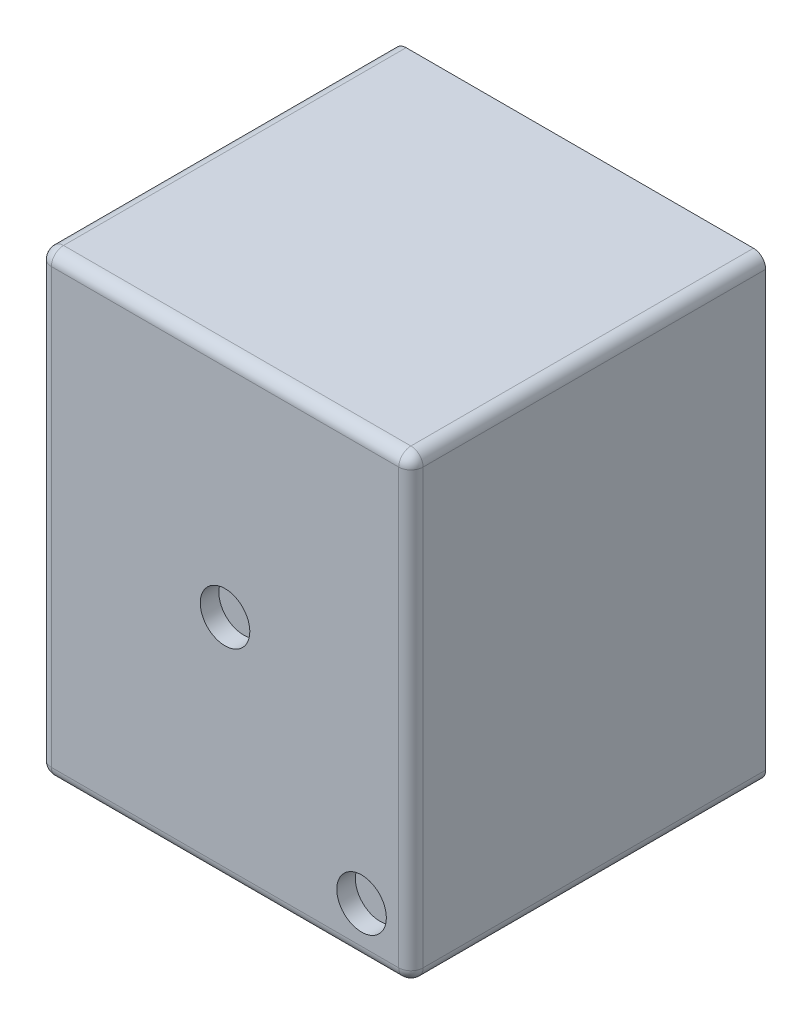
ISO-10303-21;
HEADER;
FILE_DESCRIPTION(('STEP AP214'),'2;1');
FILE_NAME('part.step','',(''),(''),'','','');
FILE_SCHEMA(('AUTOMOTIVE_DESIGN { 1 0 10303 214 1 1 1 1 }'));
ENDSEC;
DATA;
#1=APPLICATION_CONTEXT('core data for automotive mechanical design processes');
#2=APPLICATION_PROTOCOL_DEFINITION('international standard','automotive_design',2000,#1);
#3=PRODUCT_CONTEXT('',#1,'mechanical');
#4=PRODUCT('Part','Part','',(#3));
#5=PRODUCT_RELATED_PRODUCT_CATEGORY('part','',(#4));
#6=PRODUCT_DEFINITION_FORMATION('','',#4);
#7=PRODUCT_DEFINITION_CONTEXT('part definition',#1,'design');
#8=PRODUCT_DEFINITION('design','',#6,#7);
#9=PRODUCT_DEFINITION_SHAPE('','',#8);
#10=(LENGTH_UNIT() NAMED_UNIT(*) SI_UNIT(.MILLI.,.METRE.));
#11=(NAMED_UNIT(*) PLANE_ANGLE_UNIT() SI_UNIT($,.RADIAN.));
#12=(NAMED_UNIT(*) SI_UNIT($,.STERADIAN.) SOLID_ANGLE_UNIT());
#13=UNCERTAINTY_MEASURE_WITH_UNIT(LENGTH_MEASURE(1.E-05),#10,'distance_accuracy_value','');
#14=(GEOMETRIC_REPRESENTATION_CONTEXT(3) GLOBAL_UNCERTAINTY_ASSIGNED_CONTEXT((#13)) GLOBAL_UNIT_ASSIGNED_CONTEXT((#10,
#11,#12)) REPRESENTATION_CONTEXT('',''));
#15=CARTESIAN_POINT('',(0.,0.,0.));
#16=DIRECTION('',(0.,0.,1.));
#17=DIRECTION('',(1.,0.,0.));
#18=AXIS2_PLACEMENT_3D('',#15,#16,#17);
#19=CARTESIAN_POINT('',(1.02763571469062,0.168780356945077,0.617807641667743));
#20=DIRECTION('',(0.,0.,1.));
#21=DIRECTION('',(1.,0.,0.));
#22=AXIS2_PLACEMENT_3D('',#19,#20,#21);
#23=PLANE('',#22);
#24=CARTESIAN_POINT('',(1.02763571469062,0.168780356945077,0.617807641667743));
#25=DIRECTION('',(0.,0.,1.));
#26=DIRECTION('',(1.,0.,0.));
#27=AXIS2_PLACEMENT_3D('',#24,#25,#26);
#28=CIRCLE('',#27,0.04);
#29=CARTESIAN_POINT('',(1.06763571469062,0.168780356945077,0.617807641667743));
#30=VERTEX_POINT('',#29);
#31=EDGE_CURVE('E20',#30,#30,#28,.T.);
#32=ORIENTED_EDGE('',*,*,#31,.T.);
#33=EDGE_LOOP('',(#32));
#34=FACE_BOUND('',#33,.T.);
#35=ADVANCED_FACE('F17',(#34),#23,.T.);
#36=CARTESIAN_POINT('',(1.24807975754592,-0.121368087614107,0.617807641667743));
#37=DIRECTION('',(0.,0.,1.));
#38=DIRECTION('',(1.,0.,0.));
#39=AXIS2_PLACEMENT_3D('',#36,#37,#38);
#40=PLANE('',#39);
#41=CARTESIAN_POINT('',(1.24807975754592,-0.121368087614107,0.617807641667743));
#42=DIRECTION('',(0.,0.,1.));
#43=DIRECTION('',(1.,0.,0.));
#44=AXIS2_PLACEMENT_3D('',#41,#42,#43);
#45=CIRCLE('',#44,0.04);
#46=CARTESIAN_POINT('',(1.28807975754592,-0.121368087614107,0.617807641667743));
#47=VERTEX_POINT('',#46);
#48=EDGE_CURVE('E175',#47,#47,#45,.T.);
#49=ORIENTED_EDGE('',*,*,#48,.T.);
#50=EDGE_LOOP('',(#49));
#51=FACE_BOUND('',#50,.T.);
#52=ADVANCED_FACE('F187',(#51),#40,.T.);
#53=CARTESIAN_POINT('',(1.02763571469062,0.168780356945077,0.647807641667743));
#54=DIRECTION('',(0.,0.,1.));
#55=DIRECTION('',(1.,0.,0.));
#56=AXIS2_PLACEMENT_3D('',#53,#54,#55);
#57=CYLINDRICAL_SURFACE('',#56,0.04);
#58=ORIENTED_EDGE('',*,*,#31,.F.);
#59=EDGE_LOOP('',(#58));
#60=FACE_BOUND('',#59,.T.);
#61=CARTESIAN_POINT('',(1.02763571469062,0.168780356945077,0.647807641667743));
#62=DIRECTION('',(0.,0.,1.));
#63=DIRECTION('',(1.,0.,0.));
#64=AXIS2_PLACEMENT_3D('',#61,#62,#63);
#65=CIRCLE('',#64,0.04);
#66=CARTESIAN_POINT('',(1.06763571469062,0.168780356945077,0.647807641667743));
#67=VERTEX_POINT('',#66);
#68=EDGE_CURVE('E173',#67,#67,#65,.T.);
#69=ORIENTED_EDGE('',*,*,#68,.T.);
#70=EDGE_LOOP('',(#69));
#71=FACE_BOUND('',#70,.T.);
#72=ADVANCED_FACE('F183',(#60,#71),#57,.F.);
#73=CARTESIAN_POINT('',(1.24807975754592,-0.121368087614107,0.647807641667743));
#74=DIRECTION('',(0.,0.,1.));
#75=DIRECTION('',(1.,0.,0.));
#76=AXIS2_PLACEMENT_3D('',#73,#74,#75);
#77=CYLINDRICAL_SURFACE('',#76,0.04);
#78=ORIENTED_EDGE('',*,*,#48,.F.);
#79=EDGE_LOOP('',(#78));
#80=FACE_BOUND('',#79,.T.);
#81=CARTESIAN_POINT('',(1.24807975754592,-0.121368087614107,0.647807641667743));
#82=DIRECTION('',(0.,0.,1.));
#83=DIRECTION('',(1.,0.,0.));
#84=AXIS2_PLACEMENT_3D('',#81,#82,#83);
#85=CIRCLE('',#84,0.04);
#86=CARTESIAN_POINT('',(1.28807975754592,-0.121368087614107,0.647807641667743));
#87=VERTEX_POINT('',#86);
#88=EDGE_CURVE('E139',#87,#87,#85,.T.);
#89=ORIENTED_EDGE('',*,*,#88,.T.);
#90=EDGE_LOOP('',(#89));
#91=FACE_BOUND('',#90,.T.);
#92=ADVANCED_FACE('F186',(#80,#91),#77,.F.);
#93=CARTESIAN_POINT('',(0.719147267549789,0.55394364596018,0.647807641667743));
#94=DIRECTION('',(0.,0.,-1.));
#95=DIRECTION('',(-1.,0.,0.));
#96=AXIS2_PLACEMENT_3D('',#93,#94,#95);
#97=PLANE('',#96);
#98=DIRECTION('',(0.,-1.,0.));
#99=VECTOR('',#98,1.);
#100=CARTESIAN_POINT('',(1.30807975754592,-0.216382932070025,0.647807641667743));
#101=LINE('',#100,#99);
#102=CARTESIAN_POINT('',(1.30807975754592,0.518928801504261,0.647807641667743));
#103=VERTEX_POINT('',#102);
#104=CARTESIAN_POINT('',(1.30807975754592,-0.181368087614107,0.647807641667743));
#105=VERTEX_POINT('',#104);
#106=EDGE_CURVE('E132',#103,#105,#101,.T.);
#107=ORIENTED_EDGE('',*,*,#106,.F.);
#108=DIRECTION('',(1.,0.,0.));
#109=VECTOR('',#108,1.);
#110=CARTESIAN_POINT('',(1.33612416183145,0.518928801504262,0.647807641667743));
#111=LINE('',#110,#109);
#112=CARTESIAN_POINT('',(0.747191671835318,0.518928801504262,0.647807641667743));
#113=VERTEX_POINT('',#112);
#114=EDGE_CURVE('E126',#113,#103,#111,.T.);
#115=ORIENTED_EDGE('',*,*,#114,.F.);
#116=DIRECTION('',(0.,1.,0.));
#117=VECTOR('',#116,1.);
#118=CARTESIAN_POINT('',(0.747191671835318,0.55394364596018,0.647807641667743));
#119=LINE('',#118,#117);
#120=CARTESIAN_POINT('',(0.747191671835318,-0.181368087614107,0.647807641667743));
#121=VERTEX_POINT('',#120);
#122=EDGE_CURVE('E155',#121,#113,#119,.T.);
#123=ORIENTED_EDGE('',*,*,#122,.F.);
#124=DIRECTION('',(-1.,0.,0.));
#125=VECTOR('',#124,1.);
#126=CARTESIAN_POINT('',(0.719147267549787,-0.181368087614107,0.647807641667743));
#127=LINE('',#126,#125);
#128=EDGE_CURVE('E131',#105,#121,#127,.T.);
#129=ORIENTED_EDGE('',*,*,#128,.F.);
#130=EDGE_LOOP('',(#107,#115,#123,#129));
#131=FACE_BOUND('',#130,.T.);
#132=ORIENTED_EDGE('',*,*,#88,.F.);
#133=EDGE_LOOP('',(#132));
#134=FACE_BOUND('',#133,.T.);
#135=ORIENTED_EDGE('',*,*,#68,.F.);
#136=EDGE_LOOP('',(#135));
#137=FACE_BOUND('',#136,.T.);
#138=ADVANCED_FACE('F135',(#131,#134,#137),#97,.F.);
#139=CARTESIAN_POINT('',(0.719147267549787,-0.181368087614107,0.628135510520202));
#140=DIRECTION('',(-1.,0.,0.));
#141=DIRECTION('',(0.,-1.,0.));
#142=AXIS2_PLACEMENT_3D('',#139,#140,#141);
#143=CYLINDRICAL_SURFACE('',#142,0.019672131147541);
#144=DIRECTION('',(1.,0.,0.));
#145=VECTOR('',#144,1.);
#146=CARTESIAN_POINT('',(0.727519540687777,-0.201040218761648,0.628135510520202));
#147=LINE('',#146,#145);
#148=CARTESIAN_POINT('',(1.30807975754592,-0.201040218761648,0.628135510520202));
#149=VERTEX_POINT('',#148);
#150=CARTESIAN_POINT('',(0.747191671835317,-0.201040218761648,0.628135510520202));
#151=VERTEX_POINT('',#150);
#152=EDGE_CURVE('E293',#149,#151,#147,.F.);
#153=ORIENTED_EDGE('',*,*,#152,.F.);
#154=CARTESIAN_POINT('',(1.30807975754592,-0.181368087614107,0.628135510520202));
#155=DIRECTION('',(-1.,0.,0.));
#156=DIRECTION('',(0.,-1.,0.));
#157=AXIS2_PLACEMENT_3D('',#154,#155,#156);
#158=CIRCLE('',#157,0.019672131147541);
#159=EDGE_CURVE('E147',#105,#149,#158,.F.);
#160=ORIENTED_EDGE('',*,*,#159,.F.);
#161=ORIENTED_EDGE('',*,*,#128,.T.);
#162=CARTESIAN_POINT('',(0.747191671835317,-0.181368087614107,0.628135510520202));
#163=DIRECTION('',(-1.,0.,0.));
#164=DIRECTION('',(0.,-1.,0.));
#165=AXIS2_PLACEMENT_3D('',#162,#163,#164);
#166=CIRCLE('',#165,0.019672131147541);
#167=EDGE_CURVE('E260',#151,#121,#166,.T.);
#168=ORIENTED_EDGE('',*,*,#167,.F.);
#169=EDGE_LOOP('',(#153,#160,#161,#168));
#170=FACE_BOUND('',#169,.T.);
#171=ADVANCED_FACE('F192',(#170),#143,.T.);
#172=CARTESIAN_POINT('',(1.30807975754592,-0.181368087614107,0.628135510520202));
#173=DIRECTION('',(0.,-1.,0.));
#174=DIRECTION('',(0.,0.,1.));
#175=AXIS2_PLACEMENT_3D('',#172,#173,#174);
#176=SPHERICAL_SURFACE('',#175,0.019672131147541);
#177=CARTESIAN_POINT('',(1.30807975754592,-0.181368087614107,0.628135510520202));
#178=DIRECTION('',(0.,-1.,0.));
#179=DIRECTION('',(1.,0.,0.));
#180=AXIS2_PLACEMENT_3D('',#177,#178,#179);
#181=CIRCLE('',#180,0.019672131147541);
#182=CARTESIAN_POINT('',(1.32775188869346,-0.181368087614107,0.628135510520202));
#183=VERTEX_POINT('',#182);
#184=EDGE_CURVE('E106',#105,#183,#181,.F.);
#185=ORIENTED_EDGE('',*,*,#184,.F.);
#186=ORIENTED_EDGE('',*,*,#159,.T.);
#187=CARTESIAN_POINT('',(1.30807975754592,-0.181368087614107,0.628135510520202));
#188=DIRECTION('',(0.,0.,-1.));
#189=DIRECTION('',(-1.,0.,0.));
#190=AXIS2_PLACEMENT_3D('',#187,#188,#189);
#191=CIRCLE('',#190,0.019672131147541);
#192=EDGE_CURVE('E283',#183,#149,#191,.T.);
#193=ORIENTED_EDGE('',*,*,#192,.F.);
#194=EDGE_LOOP('',(#185,#186,#193));
#195=FACE_BOUND('',#194,.T.);
#196=ADVANCED_FACE('F199',(#195),#176,.T.);
#197=CARTESIAN_POINT('',(1.30807975754592,-0.216382932070025,0.628135510520202));
#198=DIRECTION('',(0.,-1.,0.));
#199=DIRECTION('',(1.,0.,0.));
#200=AXIS2_PLACEMENT_3D('',#197,#198,#199);
#201=CYLINDRICAL_SURFACE('',#200,0.019672131147541);
#202=DIRECTION('',(0.,1.,0.));
#203=VECTOR('',#202,1.);
#204=CARTESIAN_POINT('',(1.32775188869346,-0.201040218761648,0.628135510520202));
#205=LINE('',#204,#203);
#206=CARTESIAN_POINT('',(1.32775188869346,0.518928801504261,0.628135510520202));
#207=VERTEX_POINT('',#206);
#208=EDGE_CURVE('E144',#207,#183,#205,.F.);
#209=ORIENTED_EDGE('',*,*,#208,.F.);
#210=CARTESIAN_POINT('',(1.30807975754592,0.518928801504261,0.628135510520202));
#211=DIRECTION('',(0.,-1.,0.));
#212=DIRECTION('',(0.,0.,1.));
#213=AXIS2_PLACEMENT_3D('',#210,#211,#212);
#214=CIRCLE('',#213,0.0196721311475411);
#215=EDGE_CURVE('E115',#103,#207,#214,.F.);
#216=ORIENTED_EDGE('',*,*,#215,.F.);
#217=ORIENTED_EDGE('',*,*,#106,.T.);
#218=ORIENTED_EDGE('',*,*,#184,.T.);
#219=EDGE_LOOP('',(#209,#216,#217,#218));
#220=FACE_BOUND('',#219,.T.);
#221=ADVANCED_FACE('F142',(#220),#201,.T.);
#222=CARTESIAN_POINT('',(1.30807975754592,0.518928801504261,0.628135510520202));
#223=DIRECTION('',(0.,-1.,0.));
#224=DIRECTION('',(0.,0.,1.));
#225=AXIS2_PLACEMENT_3D('',#222,#223,#224);
#226=SPHERICAL_SURFACE('',#225,0.019672131147541);
#227=CARTESIAN_POINT('',(1.30807975754592,0.518928801504261,0.628135510520202));
#228=DIRECTION('',(1.,0.,0.));
#229=DIRECTION('',(0.,1.,0.));
#230=AXIS2_PLACEMENT_3D('',#227,#228,#229);
#231=CIRCLE('',#230,0.019672131147541);
#232=CARTESIAN_POINT('',(1.30807975754592,0.538600932651802,0.628135510520202));
#233=VERTEX_POINT('',#232);
#234=EDGE_CURVE('E111',#103,#233,#231,.F.);
#235=ORIENTED_EDGE('',*,*,#234,.F.);
#236=ORIENTED_EDGE('',*,*,#215,.T.);
#237=CARTESIAN_POINT('',(1.30807975754592,0.518928801504261,0.628135510520202));
#238=DIRECTION('',(0.,0.,-1.));
#239=DIRECTION('',(-1.,0.,0.));
#240=AXIS2_PLACEMENT_3D('',#237,#238,#239);
#241=CIRCLE('',#240,0.019672131147541);
#242=EDGE_CURVE('E117',#233,#207,#241,.T.);
#243=ORIENTED_EDGE('',*,*,#242,.F.);
#244=EDGE_LOOP('',(#235,#236,#243));
#245=FACE_BOUND('',#244,.T.);
#246=ADVANCED_FACE('F113',(#245),#226,.T.);
#247=CARTESIAN_POINT('',(1.33612416183145,0.518928801504261,0.628135510520202));
#248=DIRECTION('',(1.,0.,0.));
#249=DIRECTION('',(0.,1.,0.));
#250=AXIS2_PLACEMENT_3D('',#247,#248,#249);
#251=CYLINDRICAL_SURFACE('',#250,0.019672131147541);
#252=DIRECTION('',(-1.,0.,0.));
#253=VECTOR('',#252,1.);
#254=CARTESIAN_POINT('',(1.32775188869346,0.538600932651802,0.628135510520202));
#255=LINE('',#254,#253);
#256=CARTESIAN_POINT('',(0.747191671835318,0.538600932651803,0.628135510520202));
#257=VERTEX_POINT('',#256);
#258=EDGE_CURVE('E265',#257,#233,#255,.F.);
#259=ORIENTED_EDGE('',*,*,#258,.F.);
#260=CARTESIAN_POINT('',(0.747191671835318,0.518928801504262,0.628135510520202));
#261=DIRECTION('',(-1.,0.,0.));
#262=DIRECTION('',(0.,-1.,0.));
#263=AXIS2_PLACEMENT_3D('',#260,#261,#262);
#264=CIRCLE('',#263,0.019672131147541);
#265=EDGE_CURVE('E122',#113,#257,#264,.T.);
#266=ORIENTED_EDGE('',*,*,#265,.F.);
#267=ORIENTED_EDGE('',*,*,#114,.T.);
#268=ORIENTED_EDGE('',*,*,#234,.T.);
#269=EDGE_LOOP('',(#259,#266,#267,#268));
#270=FACE_BOUND('',#269,.T.);
#271=ADVANCED_FACE('F128',(#270),#251,.T.);
#272=CARTESIAN_POINT('',(0.747191671835318,0.518928801504262,0.628135510520202));
#273=DIRECTION('',(0.,-1.,0.));
#274=DIRECTION('',(0.,0.,1.));
#275=AXIS2_PLACEMENT_3D('',#272,#273,#274);
#276=SPHERICAL_SURFACE('',#275,0.019672131147541);
#277=CARTESIAN_POINT('',(0.747191671835318,0.518928801504262,0.628135510520202));
#278=DIRECTION('',(0.,1.,0.));
#279=DIRECTION('',(-1.,0.,0.));
#280=AXIS2_PLACEMENT_3D('',#277,#278,#279);
#281=CIRCLE('',#280,0.019672131147541);
#282=CARTESIAN_POINT('',(0.727519540687777,0.518928801504262,0.628135510520202));
#283=VERTEX_POINT('',#282);
#284=EDGE_CURVE('E258',#113,#283,#281,.F.);
#285=ORIENTED_EDGE('',*,*,#284,.F.);
#286=ORIENTED_EDGE('',*,*,#265,.T.);
#287=CARTESIAN_POINT('',(0.747191671835318,0.518928801504262,0.628135510520202));
#288=DIRECTION('',(0.,0.,-1.));
#289=DIRECTION('',(-1.,0.,0.));
#290=AXIS2_PLACEMENT_3D('',#287,#288,#289);
#291=CIRCLE('',#290,0.019672131147541);
#292=EDGE_CURVE('E251',#283,#257,#291,.T.);
#293=ORIENTED_EDGE('',*,*,#292,.F.);
#294=EDGE_LOOP('',(#285,#286,#293));
#295=FACE_BOUND('',#294,.T.);
#296=ADVANCED_FACE('F267',(#295),#276,.T.);
#297=CARTESIAN_POINT('',(0.747191671835318,0.55394364596018,0.628135510520202));
#298=DIRECTION('',(0.,1.,0.));
#299=DIRECTION('',(-1.,0.,0.));
#300=AXIS2_PLACEMENT_3D('',#297,#298,#299);
#301=CYLINDRICAL_SURFACE('',#300,0.019672131147541);
#302=DIRECTION('',(0.,-1.,0.));
#303=VECTOR('',#302,1.);
#304=CARTESIAN_POINT('',(0.727519540687777,0.538600932651803,0.628135510520202));
#305=LINE('',#304,#303);
#306=CARTESIAN_POINT('',(0.727519540687776,-0.181368087614107,0.628135510520202));
#307=VERTEX_POINT('',#306);
#308=EDGE_CURVE('E254',#307,#283,#305,.F.);
#309=ORIENTED_EDGE('',*,*,#308,.F.);
#310=CARTESIAN_POINT('',(0.747191671835317,-0.181368087614107,0.628135510520202));
#311=DIRECTION('',(0.,-1.,0.));
#312=DIRECTION('',(0.,0.,1.));
#313=AXIS2_PLACEMENT_3D('',#310,#311,#312);
#314=CIRCLE('',#313,0.0196721311475411);
#315=EDGE_CURVE('E75',#121,#307,#314,.T.);
#316=ORIENTED_EDGE('',*,*,#315,.F.);
#317=ORIENTED_EDGE('',*,*,#122,.T.);
#318=ORIENTED_EDGE('',*,*,#284,.T.);
#319=EDGE_LOOP('',(#309,#316,#317,#318));
#320=FACE_BOUND('',#319,.T.);
#321=ADVANCED_FACE('F244',(#320),#301,.T.);
#322=CARTESIAN_POINT('',(0.747191671835317,-0.181368087614107,0.628135510520202));
#323=DIRECTION('',(0.,-1.,0.));
#324=DIRECTION('',(0.,0.,1.));
#325=AXIS2_PLACEMENT_3D('',#322,#323,#324);
#326=SPHERICAL_SURFACE('',#325,0.019672131147541);
#327=ORIENTED_EDGE('',*,*,#167,.T.);
#328=ORIENTED_EDGE('',*,*,#315,.T.);
#329=CARTESIAN_POINT('',(0.747191671835317,-0.181368087614107,0.628135510520202));
#330=DIRECTION('',(0.,0.,-1.));
#331=DIRECTION('',(-1.,0.,0.));
#332=AXIS2_PLACEMENT_3D('',#329,#330,#331);
#333=CIRCLE('',#332,0.019672131147541);
#334=EDGE_CURVE('E515',#151,#307,#333,.T.);
#335=ORIENTED_EDGE('',*,*,#334,.F.);
#336=EDGE_LOOP('',(#327,#328,#335));
#337=FACE_BOUND('',#336,.T.);
#338=ADVANCED_FACE('F240',(#337),#326,.T.);
#339=CARTESIAN_POINT('',(0.727519540687777,-0.201040218761648,0.0553202271847168));
#340=DIRECTION('',(0.,-1.,0.));
#341=DIRECTION('',(1.,0.,0.));
#342=AXIS2_PLACEMENT_3D('',#339,#340,#341);
#343=PLANE('',#342);
#344=DIRECTION('',(0.,0.,1.));
#345=VECTOR('',#344,1.);
#346=CARTESIAN_POINT('',(0.747191671835317,-0.201040218761648,0.0553202271847168));
#347=LINE('',#346,#345);
#348=CARTESIAN_POINT('',(0.747191671835317,-0.201040218761648,0.0749923583322578));
#349=VERTEX_POINT('',#348);
#350=EDGE_CURVE('E67',#151,#349,#347,.F.);
#351=ORIENTED_EDGE('',*,*,#350,.T.);
#352=DIRECTION('',(1.,0.,0.));
#353=VECTOR('',#352,1.);
#354=CARTESIAN_POINT('',(1.02763571469062,-0.201040218761648,0.0749923583322578));
#355=LINE('',#354,#353);
#356=CARTESIAN_POINT('',(1.30807975754592,-0.201040218761648,0.0749923583322578));
#357=VERTEX_POINT('',#356);
#358=EDGE_CURVE('E168',#349,#357,#355,.T.);
#359=ORIENTED_EDGE('',*,*,#358,.T.);
#360=DIRECTION('',(0.,0.,-1.));
#361=VECTOR('',#360,1.);
#362=CARTESIAN_POINT('',(1.30807975754592,-0.201040218761648,0.0553202271847168));
#363=LINE('',#362,#361);
#364=EDGE_CURVE('E59',#149,#357,#363,.T.);
#365=ORIENTED_EDGE('',*,*,#364,.F.);
#366=ORIENTED_EDGE('',*,*,#152,.T.);
#367=EDGE_LOOP('',(#351,#359,#365,#366));
#368=FACE_BOUND('',#367,.T.);
#369=ADVANCED_FACE('F237',(#368),#343,.T.);
#370=CARTESIAN_POINT('',(1.30807975754592,-0.181368087614107,0.0553202271847168));
#371=DIRECTION('',(0.,0.,-1.));
#372=DIRECTION('',(-1.,0.,0.));
#373=AXIS2_PLACEMENT_3D('',#370,#371,#372);
#374=CYLINDRICAL_SURFACE('',#373,0.019672131147541);
#375=DIRECTION('',(0.,0.,1.));
#376=VECTOR('',#375,1.);
#377=CARTESIAN_POINT('',(1.32775188869346,-0.181368087614107,0.0553202271847168));
#378=LINE('',#377,#376);
#379=CARTESIAN_POINT('',(1.32775188869346,-0.181368087614107,0.0749923583322578));
#380=VERTEX_POINT('',#379);
#381=EDGE_CURVE('E282',#183,#380,#378,.F.);
#382=ORIENTED_EDGE('',*,*,#381,.F.);
#383=ORIENTED_EDGE('',*,*,#192,.T.);
#384=ORIENTED_EDGE('',*,*,#364,.T.);
#385=CARTESIAN_POINT('',(1.30807975754592,-0.181368087614107,0.0749923583322578));
#386=DIRECTION('',(0.,0.,-1.));
#387=DIRECTION('',(-1.,0.,0.));
#388=AXIS2_PLACEMENT_3D('',#385,#386,#387);
#389=CIRCLE('',#388,0.019672131147541);
#390=EDGE_CURVE('E166',#357,#380,#389,.F.);
#391=ORIENTED_EDGE('',*,*,#390,.T.);
#392=EDGE_LOOP('',(#382,#383,#384,#391));
#393=FACE_BOUND('',#392,.T.);
#394=ADVANCED_FACE('F233',(#393),#374,.T.);
#395=CARTESIAN_POINT('',(1.32775188869346,-0.201040218761648,0.0553202271847168));
#396=DIRECTION('',(1.,0.,0.));
#397=DIRECTION('',(0.,1.,0.));
#398=AXIS2_PLACEMENT_3D('',#395,#396,#397);
#399=PLANE('',#398);
#400=ORIENTED_EDGE('',*,*,#208,.T.);
#401=ORIENTED_EDGE('',*,*,#381,.T.);
#402=DIRECTION('',(0.,1.,0.));
#403=VECTOR('',#402,1.);
#404=CARTESIAN_POINT('',(1.32775188869346,0.168780356945077,0.0749923583322578));
#405=LINE('',#404,#403);
#406=CARTESIAN_POINT('',(1.32775188869346,0.518928801504261,0.0749923583322578));
#407=VERTEX_POINT('',#406);
#408=EDGE_CURVE('E165',#380,#407,#405,.T.);
#409=ORIENTED_EDGE('',*,*,#408,.T.);
#410=DIRECTION('',(0.,0.,-1.));
#411=VECTOR('',#410,1.);
#412=CARTESIAN_POINT('',(1.32775188869346,0.518928801504261,0.0553202271847168));
#413=LINE('',#412,#411);
#414=EDGE_CURVE('E533',#207,#407,#413,.T.);
#415=ORIENTED_EDGE('',*,*,#414,.F.);
#416=EDGE_LOOP('',(#400,#401,#409,#415));
#417=FACE_BOUND('',#416,.T.);
#418=ADVANCED_FACE('F229',(#417),#399,.T.);
#419=CARTESIAN_POINT('',(1.30807975754592,0.518928801504261,0.0553202271847168));
#420=DIRECTION('',(0.,0.,-1.));
#421=DIRECTION('',(-1.,0.,0.));
#422=AXIS2_PLACEMENT_3D('',#419,#420,#421);
#423=CYLINDRICAL_SURFACE('',#422,0.019672131147541);
#424=DIRECTION('',(0.,0.,1.));
#425=VECTOR('',#424,1.);
#426=CARTESIAN_POINT('',(1.30807975754592,0.538600932651802,0.0553202271847168));
#427=LINE('',#426,#425);
#428=CARTESIAN_POINT('',(1.30807975754592,0.538600932651802,0.0749923583322578));
#429=VERTEX_POINT('',#428);
#430=EDGE_CURVE('E526',#233,#429,#427,.F.);
#431=ORIENTED_EDGE('',*,*,#430,.F.);
#432=ORIENTED_EDGE('',*,*,#242,.T.);
#433=ORIENTED_EDGE('',*,*,#414,.T.);
#434=CARTESIAN_POINT('',(1.30807975754592,0.518928801504261,0.0749923583322578));
#435=DIRECTION('',(0.,0.,-1.));
#436=DIRECTION('',(-1.,0.,0.));
#437=AXIS2_PLACEMENT_3D('',#434,#435,#436);
#438=CIRCLE('',#437,0.019672131147541);
#439=EDGE_CURVE('E163',#407,#429,#438,.F.);
#440=ORIENTED_EDGE('',*,*,#439,.T.);
#441=EDGE_LOOP('',(#431,#432,#433,#440));
#442=FACE_BOUND('',#441,.T.);
#443=ADVANCED_FACE('F225',(#442),#423,.T.);
#444=CARTESIAN_POINT('',(1.32775188869346,0.538600932651802,0.0553202271847168));
#445=DIRECTION('',(0.,1.,0.));
#446=DIRECTION('',(-1.,0.,0.));
#447=AXIS2_PLACEMENT_3D('',#444,#445,#446);
#448=PLANE('',#447);
#449=ORIENTED_EDGE('',*,*,#258,.T.);
#450=ORIENTED_EDGE('',*,*,#430,.T.);
#451=DIRECTION('',(1.,0.,0.));
#452=VECTOR('',#451,1.);
#453=CARTESIAN_POINT('',(1.02763571469062,0.538600932651802,0.0749923583322578));
#454=LINE('',#453,#452);
#455=CARTESIAN_POINT('',(0.747191671835318,0.538600932651803,0.0749923583322578));
#456=VERTEX_POINT('',#455);
#457=EDGE_CURVE('E162',#429,#456,#454,.F.);
#458=ORIENTED_EDGE('',*,*,#457,.T.);
#459=DIRECTION('',(0.,0.,-1.));
#460=VECTOR('',#459,1.);
#461=CARTESIAN_POINT('',(0.747191671835318,0.538600932651803,0.0553202271847168));
#462=LINE('',#461,#460);
#463=EDGE_CURVE('E255',#257,#456,#462,.T.);
#464=ORIENTED_EDGE('',*,*,#463,.F.);
#465=EDGE_LOOP('',(#449,#450,#458,#464));
#466=FACE_BOUND('',#465,.T.);
#467=ADVANCED_FACE('F221',(#466),#448,.T.);
#468=CARTESIAN_POINT('',(0.747191671835318,0.518928801504262,0.0553202271847168));
#469=DIRECTION('',(0.,0.,-1.));
#470=DIRECTION('',(-1.,0.,0.));
#471=AXIS2_PLACEMENT_3D('',#468,#469,#470);
#472=CYLINDRICAL_SURFACE('',#471,0.019672131147541);
#473=DIRECTION('',(0.,0.,1.));
#474=VECTOR('',#473,1.);
#475=CARTESIAN_POINT('',(0.727519540687777,0.518928801504262,0.0553202271847168));
#476=LINE('',#475,#474);
#477=CARTESIAN_POINT('',(0.727519540687777,0.518928801504262,0.0749923583322578));
#478=VERTEX_POINT('',#477);
#479=EDGE_CURVE('E513',#283,#478,#476,.F.);
#480=ORIENTED_EDGE('',*,*,#479,.F.);
#481=ORIENTED_EDGE('',*,*,#292,.T.);
#482=ORIENTED_EDGE('',*,*,#463,.T.);
#483=CARTESIAN_POINT('',(0.747191671835318,0.518928801504262,0.0749923583322578));
#484=DIRECTION('',(0.,0.,-1.));
#485=DIRECTION('',(-1.,0.,0.));
#486=AXIS2_PLACEMENT_3D('',#483,#484,#485);
#487=CIRCLE('',#486,0.019672131147541);
#488=EDGE_CURVE('E26',#456,#478,#487,.F.);
#489=ORIENTED_EDGE('',*,*,#488,.T.);
#490=EDGE_LOOP('',(#480,#481,#482,#489));
#491=FACE_BOUND('',#490,.T.);
#492=ADVANCED_FACE('F217',(#491),#472,.T.);
#493=CARTESIAN_POINT('',(0.727519540687777,0.538600932651803,0.0553202271847168));
#494=DIRECTION('',(-1.,0.,0.));
#495=DIRECTION('',(0.,-1.,0.));
#496=AXIS2_PLACEMENT_3D('',#493,#494,#495);
#497=PLANE('',#496);
#498=ORIENTED_EDGE('',*,*,#308,.T.);
#499=ORIENTED_EDGE('',*,*,#479,.T.);
#500=DIRECTION('',(0.,1.,0.));
#501=VECTOR('',#500,1.);
#502=CARTESIAN_POINT('',(0.727519540687777,0.168780356945077,0.0749923583322578));
#503=LINE('',#502,#501);
#504=CARTESIAN_POINT('',(0.727519540687776,-0.181368087614107,0.0749923583322578));
#505=VERTEX_POINT('',#504);
#506=EDGE_CURVE('E11',#478,#505,#503,.F.);
#507=ORIENTED_EDGE('',*,*,#506,.T.);
#508=DIRECTION('',(0.,0.,-1.));
#509=VECTOR('',#508,1.);
#510=CARTESIAN_POINT('',(0.727519540687776,-0.181368087614107,0.0553202271847168));
#511=LINE('',#510,#509);
#512=EDGE_CURVE('E170',#307,#505,#511,.T.);
#513=ORIENTED_EDGE('',*,*,#512,.F.);
#514=EDGE_LOOP('',(#498,#499,#507,#513));
#515=FACE_BOUND('',#514,.T.);
#516=ADVANCED_FACE('F211',(#515),#497,.T.);
#517=CARTESIAN_POINT('',(0.747191671835317,-0.181368087614107,0.0553202271847168));
#518=DIRECTION('',(0.,0.,-1.));
#519=DIRECTION('',(-1.,0.,0.));
#520=AXIS2_PLACEMENT_3D('',#517,#518,#519);
#521=CYLINDRICAL_SURFACE('',#520,0.019672131147541);
#522=ORIENTED_EDGE('',*,*,#512,.T.);
#523=CARTESIAN_POINT('',(0.747191671835317,-0.181368087614107,0.0749923583322578));
#524=DIRECTION('',(0.,0.,-1.));
#525=DIRECTION('',(-1.,0.,0.));
#526=AXIS2_PLACEMENT_3D('',#523,#524,#525);
#527=CIRCLE('',#526,0.019672131147541);
#528=EDGE_CURVE('E35',#505,#349,#527,.F.);
#529=ORIENTED_EDGE('',*,*,#528,.T.);
#530=ORIENTED_EDGE('',*,*,#350,.F.);
#531=ORIENTED_EDGE('',*,*,#334,.T.);
#532=EDGE_LOOP('',(#522,#529,#530,#531));
#533=FACE_BOUND('',#532,.T.);
#534=ADVANCED_FACE('F206',(#533),#521,.T.);
#535=CARTESIAN_POINT('',(1.02763571469062,0.168780356945077,0.0749923583322578));
#536=DIRECTION('',(0.,0.,1.));
#537=DIRECTION('',(1.,0.,0.));
#538=AXIS2_PLACEMENT_3D('',#535,#536,#537);
#539=PLANE('',#538);
#540=ORIENTED_EDGE('',*,*,#506,.F.);
#541=ORIENTED_EDGE('',*,*,#488,.F.);
#542=ORIENTED_EDGE('',*,*,#457,.F.);
#543=ORIENTED_EDGE('',*,*,#439,.F.);
#544=ORIENTED_EDGE('',*,*,#408,.F.);
#545=ORIENTED_EDGE('',*,*,#390,.F.);
#546=ORIENTED_EDGE('',*,*,#358,.F.);
#547=ORIENTED_EDGE('',*,*,#528,.F.);
#548=EDGE_LOOP('',(#540,#541,#542,#543,#544,#545,#546,#547));
#549=FACE_BOUND('',#548,.T.);
#550=ADVANCED_FACE('F204',(#549),#539,.F.);
#551=CLOSED_SHELL('',(#35,#52,#72,#92,#138,#171,#196,#221,#246,#271,#296,#321,#338,#369,#394,
#418,#443,#467,#492,#516,#534,#550));
#552=MANIFOLD_SOLID_BREP('B1',#551);
#553=ADVANCED_BREP_SHAPE_REPRESENTATION('',(#18,#552),#14);
#554=SHAPE_DEFINITION_REPRESENTATION(#9,#553);
ENDSEC;
END-ISO-10303-21;
